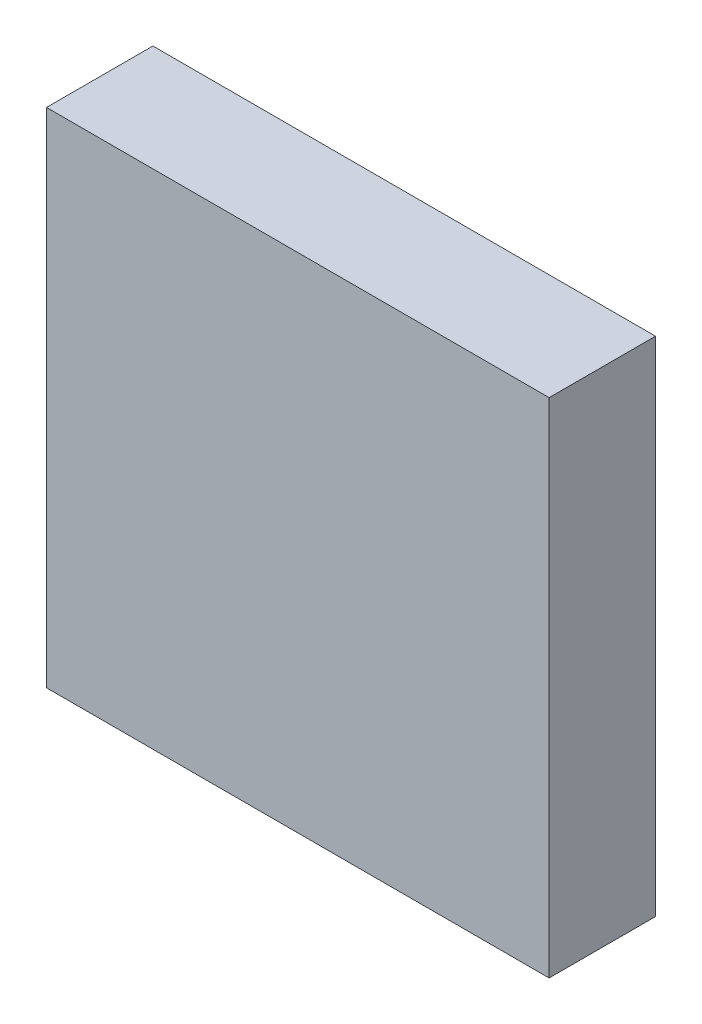
ISO-10303-21;
HEADER;
FILE_DESCRIPTION(('STEP AP214'),'2;1');
FILE_NAME('part.step','',(''),(''),'','','');
FILE_SCHEMA(('AUTOMOTIVE_DESIGN { 1 0 10303 214 1 1 1 1 }'));
ENDSEC;
DATA;
#1=APPLICATION_CONTEXT('core data for automotive mechanical design processes');
#2=APPLICATION_PROTOCOL_DEFINITION('international standard','automotive_design',2000,#1);
#3=PRODUCT_CONTEXT('',#1,'mechanical');
#4=PRODUCT('Part','Part','',(#3));
#5=PRODUCT_RELATED_PRODUCT_CATEGORY('part','',(#4));
#6=PRODUCT_DEFINITION_FORMATION('','',#4);
#7=PRODUCT_DEFINITION_CONTEXT('part definition',#1,'design');
#8=PRODUCT_DEFINITION('design','',#6,#7);
#9=PRODUCT_DEFINITION_SHAPE('','',#8);
#10=(LENGTH_UNIT() NAMED_UNIT(*) SI_UNIT(.MILLI.,.METRE.));
#11=(NAMED_UNIT(*) PLANE_ANGLE_UNIT() SI_UNIT($,.RADIAN.));
#12=(NAMED_UNIT(*) SI_UNIT($,.STERADIAN.) SOLID_ANGLE_UNIT());
#13=UNCERTAINTY_MEASURE_WITH_UNIT(LENGTH_MEASURE(1.E-05),#10,'distance_accuracy_value','');
#14=(GEOMETRIC_REPRESENTATION_CONTEXT(3) GLOBAL_UNCERTAINTY_ASSIGNED_CONTEXT((#13)) GLOBAL_UNIT_ASSIGNED_CONTEXT((#10,
#11,#12)) REPRESENTATION_CONTEXT('',''));
#15=CARTESIAN_POINT('',(0.,0.,0.));
#16=DIRECTION('',(0.,0.,1.));
#17=DIRECTION('',(1.,0.,0.));
#18=AXIS2_PLACEMENT_3D('',#15,#16,#17);
#19=CARTESIAN_POINT('',(0.5999988,-0.5999988,0.));
#20=DIRECTION('',(-1.,0.,0.));
#21=DIRECTION('',(0.,1.,0.));
#22=AXIS2_PLACEMENT_3D('',#19,#20,#21);
#23=PLANE('',#22);
#24=DIRECTION('',(0.,1.,0.));
#25=VECTOR('',#24,1.);
#26=CARTESIAN_POINT('',(0.5999988,-0.5999988,0.));
#27=LINE('',#26,#25);
#28=CARTESIAN_POINT('',(0.5999988,-0.5999988,0.));
#29=VERTEX_POINT('',#28);
#30=CARTESIAN_POINT('',(0.5999988,0.5999988,0.));
#31=VERTEX_POINT('',#30);
#32=EDGE_CURVE('E11',#29,#31,#27,.T.);
#33=ORIENTED_EDGE('',*,*,#32,.T.);
#34=DIRECTION('',(0.,0.,1.));
#35=VECTOR('',#34,1.);
#36=CARTESIAN_POINT('',(0.5999988,0.5999988,0.));
#37=LINE('',#36,#35);
#38=CARTESIAN_POINT('',(0.5999988,0.5999988,0.254));
#39=VERTEX_POINT('',#38);
#40=EDGE_CURVE('E24',#31,#39,#37,.T.);
#41=ORIENTED_EDGE('',*,*,#40,.T.);
#42=DIRECTION('',(0.,1.,0.));
#43=VECTOR('',#42,1.);
#44=CARTESIAN_POINT('',(0.5999988,-0.5999988,0.254));
#45=LINE('',#44,#43);
#46=CARTESIAN_POINT('',(0.5999988,-0.5999988,0.254));
#47=VERTEX_POINT('',#46);
#48=EDGE_CURVE('E87',#47,#39,#45,.T.);
#49=ORIENTED_EDGE('',*,*,#48,.F.);
#50=DIRECTION('',(0.,0.,1.));
#51=VECTOR('',#50,1.);
#52=CARTESIAN_POINT('',(0.5999988,-0.5999988,0.));
#53=LINE('',#52,#51);
#54=EDGE_CURVE('E36',#29,#47,#53,.T.);
#55=ORIENTED_EDGE('',*,*,#54,.F.);
#56=EDGE_LOOP('',(#33,#41,#49,#55));
#57=FACE_BOUND('',#56,.T.);
#58=ADVANCED_FACE('F17',(#57),#23,.F.);
#59=CARTESIAN_POINT('',(0.5999988,0.5999988,0.));
#60=DIRECTION('',(0.,-1.,0.));
#61=DIRECTION('',(-1.,0.,0.));
#62=AXIS2_PLACEMENT_3D('',#59,#60,#61);
#63=PLANE('',#62);
#64=DIRECTION('',(-1.,0.,0.));
#65=VECTOR('',#64,1.);
#66=CARTESIAN_POINT('',(0.5999988,0.5999988,0.));
#67=LINE('',#66,#65);
#68=CARTESIAN_POINT('',(-0.5999988,0.5999988,0.));
#69=VERTEX_POINT('',#68);
#70=EDGE_CURVE('E84',#31,#69,#67,.T.);
#71=ORIENTED_EDGE('',*,*,#70,.T.);
#72=DIRECTION('',(0.,0.,1.));
#73=VECTOR('',#72,1.);
#74=CARTESIAN_POINT('',(-0.5999988,0.5999988,0.));
#75=LINE('',#74,#73);
#76=CARTESIAN_POINT('',(-0.5999988,0.5999988,0.254));
#77=VERTEX_POINT('',#76);
#78=EDGE_CURVE('E82',#69,#77,#75,.T.);
#79=ORIENTED_EDGE('',*,*,#78,.T.);
#80=DIRECTION('',(-1.,0.,0.));
#81=VECTOR('',#80,1.);
#82=CARTESIAN_POINT('',(0.5999988,0.5999988,0.254));
#83=LINE('',#82,#81);
#84=EDGE_CURVE('E62',#39,#77,#83,.T.);
#85=ORIENTED_EDGE('',*,*,#84,.F.);
#86=ORIENTED_EDGE('',*,*,#40,.F.);
#87=EDGE_LOOP('',(#71,#79,#85,#86));
#88=FACE_BOUND('',#87,.T.);
#89=ADVANCED_FACE('F89',(#88),#63,.F.);
#90=CARTESIAN_POINT('',(-0.5999988,0.5999988,0.));
#91=DIRECTION('',(1.,0.,0.));
#92=DIRECTION('',(0.,-1.,0.));
#93=AXIS2_PLACEMENT_3D('',#90,#91,#92);
#94=PLANE('',#93);
#95=DIRECTION('',(0.,-1.,0.));
#96=VECTOR('',#95,1.);
#97=CARTESIAN_POINT('',(-0.5999988,0.5999988,0.));
#98=LINE('',#97,#96);
#99=CARTESIAN_POINT('',(-0.5999988,-0.5999988,0.));
#100=VERTEX_POINT('',#99);
#101=EDGE_CURVE('E71',#69,#100,#98,.T.);
#102=ORIENTED_EDGE('',*,*,#101,.T.);
#103=DIRECTION('',(0.,0.,1.));
#104=VECTOR('',#103,1.);
#105=CARTESIAN_POINT('',(-0.5999988,-0.5999988,0.));
#106=LINE('',#105,#104);
#107=CARTESIAN_POINT('',(-0.5999988,-0.5999988,0.254));
#108=VERTEX_POINT('',#107);
#109=EDGE_CURVE('E65',#100,#108,#106,.T.);
#110=ORIENTED_EDGE('',*,*,#109,.T.);
#111=DIRECTION('',(0.,-1.,0.));
#112=VECTOR('',#111,1.);
#113=CARTESIAN_POINT('',(-0.5999988,0.5999988,0.254));
#114=LINE('',#113,#112);
#115=EDGE_CURVE('E57',#77,#108,#114,.T.);
#116=ORIENTED_EDGE('',*,*,#115,.F.);
#117=ORIENTED_EDGE('',*,*,#78,.F.);
#118=EDGE_LOOP('',(#102,#110,#116,#117));
#119=FACE_BOUND('',#118,.T.);
#120=ADVANCED_FACE('F69',(#119),#94,.F.);
#121=CARTESIAN_POINT('',(-0.5999988,-0.5999988,0.));
#122=DIRECTION('',(0.,1.,0.));
#123=DIRECTION('',(1.,0.,0.));
#124=AXIS2_PLACEMENT_3D('',#121,#122,#123);
#125=PLANE('',#124);
#126=DIRECTION('',(1.,0.,0.));
#127=VECTOR('',#126,1.);
#128=CARTESIAN_POINT('',(-0.5999988,-0.5999988,0.));
#129=LINE('',#128,#127);
#130=EDGE_CURVE('E66',#100,#29,#129,.T.);
#131=ORIENTED_EDGE('',*,*,#130,.T.);
#132=ORIENTED_EDGE('',*,*,#54,.T.);
#133=DIRECTION('',(1.,0.,0.));
#134=VECTOR('',#133,1.);
#135=CARTESIAN_POINT('',(-0.5999988,-0.5999988,0.254));
#136=LINE('',#135,#134);
#137=EDGE_CURVE('E61',#108,#47,#136,.T.);
#138=ORIENTED_EDGE('',*,*,#137,.F.);
#139=ORIENTED_EDGE('',*,*,#109,.F.);
#140=EDGE_LOOP('',(#131,#132,#138,#139));
#141=FACE_BOUND('',#140,.T.);
#142=ADVANCED_FACE('F76',(#141),#125,.F.);
#143=CARTESIAN_POINT('',(0.,0.,0.));
#144=DIRECTION('',(0.,0.,1.));
#145=DIRECTION('',(1.,0.,0.));
#146=AXIS2_PLACEMENT_3D('',#143,#144,#145);
#147=PLANE('',#146);
#148=ORIENTED_EDGE('',*,*,#130,.F.);
#149=ORIENTED_EDGE('',*,*,#101,.F.);
#150=ORIENTED_EDGE('',*,*,#70,.F.);
#151=ORIENTED_EDGE('',*,*,#32,.F.);
#152=EDGE_LOOP('',(#148,#149,#150,#151));
#153=FACE_BOUND('',#152,.T.);
#154=ADVANCED_FACE('F91',(#153),#147,.F.);
#155=CARTESIAN_POINT('',(0.,0.,0.254));
#156=DIRECTION('',(0.,0.,1.));
#157=DIRECTION('',(1.,0.,0.));
#158=AXIS2_PLACEMENT_3D('',#155,#156,#157);
#159=PLANE('',#158);
#160=ORIENTED_EDGE('',*,*,#48,.T.);
#161=ORIENTED_EDGE('',*,*,#84,.T.);
#162=ORIENTED_EDGE('',*,*,#115,.T.);
#163=ORIENTED_EDGE('',*,*,#137,.T.);
#164=EDGE_LOOP('',(#160,#161,#162,#163));
#165=FACE_BOUND('',#164,.T.);
#166=ADVANCED_FACE('F59',(#165),#159,.T.);
#167=CLOSED_SHELL('',(#58,#89,#120,#142,#154,#166));
#168=MANIFOLD_SOLID_BREP('B1',#167);
#169=ADVANCED_BREP_SHAPE_REPRESENTATION('',(#18,#168),#14);
#170=SHAPE_DEFINITION_REPRESENTATION(#9,#169);
ENDSEC;
END-ISO-10303-21;
